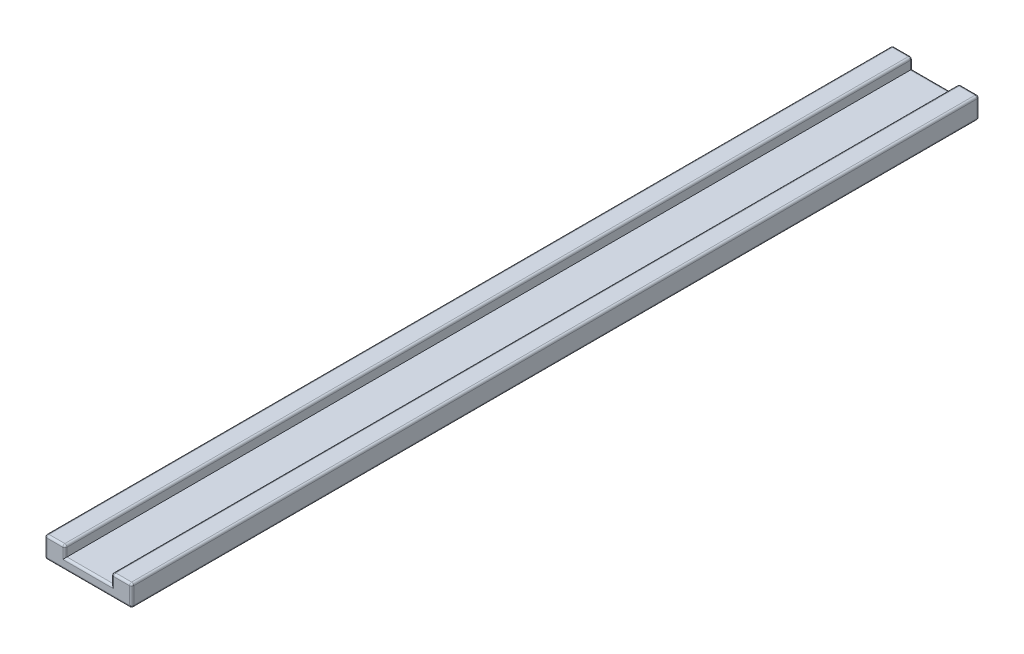
ISO-10303-21;
HEADER;
FILE_DESCRIPTION(('STEP AP214'),'2;1');
FILE_NAME('part.step','',(''),(''),'','','');
FILE_SCHEMA(('AUTOMOTIVE_DESIGN { 1 0 10303 214 1 1 1 1 }'));
ENDSEC;
DATA;
#1=APPLICATION_CONTEXT('core data for automotive mechanical design processes');
#2=APPLICATION_PROTOCOL_DEFINITION('international standard','automotive_design',2000,#1);
#3=PRODUCT_CONTEXT('',#1,'mechanical');
#4=PRODUCT('Part','Part','',(#3));
#5=PRODUCT_RELATED_PRODUCT_CATEGORY('part','',(#4));
#6=PRODUCT_DEFINITION_FORMATION('','',#4);
#7=PRODUCT_DEFINITION_CONTEXT('part definition',#1,'design');
#8=PRODUCT_DEFINITION('design','',#6,#7);
#9=PRODUCT_DEFINITION_SHAPE('','',#8);
#10=(LENGTH_UNIT() NAMED_UNIT(*) SI_UNIT(.MILLI.,.METRE.));
#11=(NAMED_UNIT(*) PLANE_ANGLE_UNIT() SI_UNIT($,.RADIAN.));
#12=(NAMED_UNIT(*) SI_UNIT($,.STERADIAN.) SOLID_ANGLE_UNIT());
#13=UNCERTAINTY_MEASURE_WITH_UNIT(LENGTH_MEASURE(1.E-05),#10,'distance_accuracy_value','');
#14=(GEOMETRIC_REPRESENTATION_CONTEXT(3) GLOBAL_UNCERTAINTY_ASSIGNED_CONTEXT((#13)) GLOBAL_UNIT_ASSIGNED_CONTEXT((#10,
#11,#12)) REPRESENTATION_CONTEXT('',''));
#15=CARTESIAN_POINT('',(0.,0.,0.));
#16=DIRECTION('',(0.,0.,1.));
#17=DIRECTION('',(1.,0.,0.));
#18=AXIS2_PLACEMENT_3D('',#15,#16,#17);
#19=CARTESIAN_POINT('',(11.,5.,400.));
#20=DIRECTION('',(0.,-1.,0.));
#21=DIRECTION('',(0.,0.,-1.));
#22=AXIS2_PLACEMENT_3D('',#19,#20,#21);
#23=PLANE('',#22);
#24=DIRECTION('',(0.,0.,-1.));
#25=VECTOR('',#24,1.);
#26=CARTESIAN_POINT('',(19.5,5.,400.));
#27=LINE('',#26,#25);
#28=CARTESIAN_POINT('',(19.5,5.,399.));
#29=VERTEX_POINT('',#28);
#30=CARTESIAN_POINT('',(19.5,5.,1.));
#31=VERTEX_POINT('',#30);
#32=EDGE_CURVE('E496',#29,#31,#27,.T.);
#33=ORIENTED_EDGE('',*,*,#32,.T.);
#34=DIRECTION('',(-1.,0.,0.));
#35=VECTOR('',#34,1.);
#36=CARTESIAN_POINT('',(11.,5.,1.));
#37=LINE('',#36,#35);
#38=CARTESIAN_POINT('',(12.,5.,1.));
#39=VERTEX_POINT('',#38);
#40=EDGE_CURVE('E294',#31,#39,#37,.T.);
#41=ORIENTED_EDGE('',*,*,#40,.T.);
#42=DIRECTION('',(0.,0.,-1.));
#43=VECTOR('',#42,1.);
#44=CARTESIAN_POINT('',(12.,5.,400.));
#45=LINE('',#44,#43);
#46=CARTESIAN_POINT('',(12.,5.,399.));
#47=VERTEX_POINT('',#46);
#48=EDGE_CURVE('E408',#39,#47,#45,.F.);
#49=ORIENTED_EDGE('',*,*,#48,.T.);
#50=DIRECTION('',(-1.,0.,0.));
#51=VECTOR('',#50,1.);
#52=CARTESIAN_POINT('',(19.5,5.,399.));
#53=LINE('',#52,#51);
#54=EDGE_CURVE('E292',#47,#29,#53,.F.);
#55=ORIENTED_EDGE('',*,*,#54,.T.);
#56=EDGE_LOOP('',(#33,#41,#49,#55));
#57=FACE_BOUND('',#56,.T.);
#58=ADVANCED_FACE('F40',(#57),#23,.F.);
#59=CARTESIAN_POINT('',(11.,0.,400.));
#60=DIRECTION('',(1.,0.,0.));
#61=DIRECTION('',(0.,1.,0.));
#62=AXIS2_PLACEMENT_3D('',#59,#60,#61);
#63=PLANE('',#62);
#64=DIRECTION('',(0.,0.,-1.));
#65=VECTOR('',#64,1.);
#66=CARTESIAN_POINT('',(11.,4.,400.));
#67=LINE('',#66,#65);
#68=CARTESIAN_POINT('',(11.,4.,399.));
#69=VERTEX_POINT('',#68);
#70=CARTESIAN_POINT('',(11.,4.,1.));
#71=VERTEX_POINT('',#70);
#72=EDGE_CURVE('E504',#69,#71,#67,.T.);
#73=ORIENTED_EDGE('',*,*,#72,.T.);
#74=DIRECTION('',(0.,-1.,0.));
#75=VECTOR('',#74,1.);
#76=CARTESIAN_POINT('',(11.,0.,1.));
#77=LINE('',#76,#75);
#78=CARTESIAN_POINT('',(11.,0.,1.));
#79=VERTEX_POINT('',#78);
#80=EDGE_CURVE('E302',#71,#79,#77,.T.);
#81=ORIENTED_EDGE('',*,*,#80,.T.);
#82=DIRECTION('',(0.,0.,-1.));
#83=VECTOR('',#82,1.);
#84=CARTESIAN_POINT('',(11.,0.,400.));
#85=LINE('',#84,#83);
#86=CARTESIAN_POINT('',(11.,0.,399.));
#87=VERTEX_POINT('',#86);
#88=EDGE_CURVE('E212',#87,#79,#85,.T.);
#89=ORIENTED_EDGE('',*,*,#88,.F.);
#90=DIRECTION('',(0.,-1.,0.));
#91=VECTOR('',#90,1.);
#92=CARTESIAN_POINT('',(11.,4.,399.));
#93=LINE('',#92,#91);
#94=EDGE_CURVE('E300',#87,#69,#93,.F.);
#95=ORIENTED_EDGE('',*,*,#94,.T.);
#96=EDGE_LOOP('',(#73,#81,#89,#95));
#97=FACE_BOUND('',#96,.T.);
#98=ADVANCED_FACE('F560',(#97),#63,.F.);
#99=CARTESIAN_POINT('',(-11.,0.,400.));
#100=DIRECTION('',(0.,-1.,0.));
#101=DIRECTION('',(0.,0.,-1.));
#102=AXIS2_PLACEMENT_3D('',#99,#100,#101);
#103=PLANE('',#102);
#104=ORIENTED_EDGE('',*,*,#88,.T.);
#105=DIRECTION('',(-1.,0.,0.));
#106=VECTOR('',#105,1.);
#107=CARTESIAN_POINT('',(-11.,0.,1.));
#108=LINE('',#107,#106);
#109=CARTESIAN_POINT('',(-11.,0.,1.));
#110=VERTEX_POINT('',#109);
#111=EDGE_CURVE('E211',#79,#110,#108,.T.);
#112=ORIENTED_EDGE('',*,*,#111,.T.);
#113=DIRECTION('',(0.,0.,-1.));
#114=VECTOR('',#113,1.);
#115=CARTESIAN_POINT('',(-11.,0.,400.));
#116=LINE('',#115,#114);
#117=CARTESIAN_POINT('',(-11.,0.,399.));
#118=VERTEX_POINT('',#117);
#119=EDGE_CURVE('E193',#118,#110,#116,.T.);
#120=ORIENTED_EDGE('',*,*,#119,.F.);
#121=DIRECTION('',(-1.,0.,0.));
#122=VECTOR('',#121,1.);
#123=CARTESIAN_POINT('',(11.,0.,399.));
#124=LINE('',#123,#122);
#125=EDGE_CURVE('E208',#118,#87,#124,.F.);
#126=ORIENTED_EDGE('',*,*,#125,.T.);
#127=EDGE_LOOP('',(#104,#112,#120,#126));
#128=FACE_BOUND('',#127,.T.);
#129=ADVANCED_FACE('F206',(#128),#103,.F.);
#130=CARTESIAN_POINT('',(-11.,5.,400.));
#131=DIRECTION('',(-1.,0.,0.));
#132=DIRECTION('',(0.,-1.,0.));
#133=AXIS2_PLACEMENT_3D('',#130,#131,#132);
#134=PLANE('',#133);
#135=ORIENTED_EDGE('',*,*,#119,.T.);
#136=DIRECTION('',(0.,1.,0.));
#137=VECTOR('',#136,1.);
#138=CARTESIAN_POINT('',(-11.,5.,1.));
#139=LINE('',#138,#137);
#140=CARTESIAN_POINT('',(-11.,4.,1.));
#141=VERTEX_POINT('',#140);
#142=EDGE_CURVE('E200',#110,#141,#139,.T.);
#143=ORIENTED_EDGE('',*,*,#142,.T.);
#144=DIRECTION('',(0.,0.,-1.));
#145=VECTOR('',#144,1.);
#146=CARTESIAN_POINT('',(-11.,4.,400.));
#147=LINE('',#146,#145);
#148=CARTESIAN_POINT('',(-11.,4.,399.));
#149=VERTEX_POINT('',#148);
#150=EDGE_CURVE('E195',#141,#149,#147,.F.);
#151=ORIENTED_EDGE('',*,*,#150,.T.);
#152=DIRECTION('',(0.,1.,0.));
#153=VECTOR('',#152,1.);
#154=CARTESIAN_POINT('',(-11.,0.,399.));
#155=LINE('',#154,#153);
#156=EDGE_CURVE('E190',#149,#118,#155,.F.);
#157=ORIENTED_EDGE('',*,*,#156,.T.);
#158=EDGE_LOOP('',(#135,#143,#151,#157));
#159=FACE_BOUND('',#158,.T.);
#160=ADVANCED_FACE('F192',(#159),#134,.F.);
#161=CARTESIAN_POINT('',(-20.5,5.,400.));
#162=DIRECTION('',(0.,-1.,0.));
#163=DIRECTION('',(0.,0.,-1.));
#164=AXIS2_PLACEMENT_3D('',#161,#162,#163);
#165=PLANE('',#164);
#166=DIRECTION('',(0.,0.,-1.));
#167=VECTOR('',#166,1.);
#168=CARTESIAN_POINT('',(-12.,5.,400.));
#169=LINE('',#168,#167);
#170=CARTESIAN_POINT('',(-12.,5.,399.));
#171=VERTEX_POINT('',#170);
#172=CARTESIAN_POINT('',(-12.,5.,1.));
#173=VERTEX_POINT('',#172);
#174=EDGE_CURVE('E398',#171,#173,#169,.T.);
#175=ORIENTED_EDGE('',*,*,#174,.T.);
#176=DIRECTION('',(-1.,0.,0.));
#177=VECTOR('',#176,1.);
#178=CARTESIAN_POINT('',(-20.5,5.,1.));
#179=LINE('',#178,#177);
#180=CARTESIAN_POINT('',(-19.5,5.,1.));
#181=VERTEX_POINT('',#180);
#182=EDGE_CURVE('E261',#173,#181,#179,.T.);
#183=ORIENTED_EDGE('',*,*,#182,.T.);
#184=DIRECTION('',(0.,0.,-1.));
#185=VECTOR('',#184,1.);
#186=CARTESIAN_POINT('',(-19.5,5.,400.));
#187=LINE('',#186,#185);
#188=CARTESIAN_POINT('',(-19.5,5.,399.));
#189=VERTEX_POINT('',#188);
#190=EDGE_CURVE('E401',#181,#189,#187,.F.);
#191=ORIENTED_EDGE('',*,*,#190,.T.);
#192=DIRECTION('',(-1.,0.,0.));
#193=VECTOR('',#192,1.);
#194=CARTESIAN_POINT('',(-12.,5.,399.));
#195=LINE('',#194,#193);
#196=EDGE_CURVE('E259',#189,#171,#195,.F.);
#197=ORIENTED_EDGE('',*,*,#196,.T.);
#198=EDGE_LOOP('',(#175,#183,#191,#197));
#199=FACE_BOUND('',#198,.T.);
#200=ADVANCED_FACE('F397',(#199),#165,.F.);
#201=CARTESIAN_POINT('',(-20.5,-5.,400.));
#202=DIRECTION('',(1.,0.,0.));
#203=DIRECTION('',(0.,0.,-1.));
#204=AXIS2_PLACEMENT_3D('',#201,#202,#203);
#205=PLANE('',#204);
#206=DIRECTION('',(0.,0.,-1.));
#207=VECTOR('',#206,1.);
#208=CARTESIAN_POINT('',(-20.5,4.,400.));
#209=LINE('',#208,#207);
#210=CARTESIAN_POINT('',(-20.5,4.,399.));
#211=VERTEX_POINT('',#210);
#212=CARTESIAN_POINT('',(-20.5,4.,1.));
#213=VERTEX_POINT('',#212);
#214=EDGE_CURVE('E235',#211,#213,#209,.T.);
#215=ORIENTED_EDGE('',*,*,#214,.T.);
#216=DIRECTION('',(0.,-1.,0.));
#217=VECTOR('',#216,1.);
#218=CARTESIAN_POINT('',(-20.5,-5.,1.));
#219=LINE('',#218,#217);
#220=CARTESIAN_POINT('',(-20.5,-4.,1.));
#221=VERTEX_POINT('',#220);
#222=EDGE_CURVE('E269',#213,#221,#219,.T.);
#223=ORIENTED_EDGE('',*,*,#222,.T.);
#224=DIRECTION('',(0.,0.,-1.));
#225=VECTOR('',#224,1.);
#226=CARTESIAN_POINT('',(-20.5,-4.,400.));
#227=LINE('',#226,#225);
#228=CARTESIAN_POINT('',(-20.5,-4.,399.));
#229=VERTEX_POINT('',#228);
#230=EDGE_CURVE('E230',#221,#229,#227,.F.);
#231=ORIENTED_EDGE('',*,*,#230,.T.);
#232=DIRECTION('',(0.,-1.,0.));
#233=VECTOR('',#232,1.);
#234=CARTESIAN_POINT('',(-20.5,4.,399.));
#235=LINE('',#234,#233);
#236=EDGE_CURVE('E267',#229,#211,#235,.F.);
#237=ORIENTED_EDGE('',*,*,#236,.T.);
#238=EDGE_LOOP('',(#215,#223,#231,#237));
#239=FACE_BOUND('',#238,.T.);
#240=ADVANCED_FACE('F426',(#239),#205,.F.);
#241=CARTESIAN_POINT('',(-20.5,-5.,400.));
#242=DIRECTION('',(0.,1.,0.));
#243=DIRECTION('',(0.,0.,1.));
#244=AXIS2_PLACEMENT_3D('',#241,#242,#243);
#245=PLANE('',#244);
#246=DIRECTION('',(0.,0.,-1.));
#247=VECTOR('',#246,1.);
#248=CARTESIAN_POINT('',(-19.5,-5.,400.));
#249=LINE('',#248,#247);
#250=CARTESIAN_POINT('',(-19.5,-5.,399.));
#251=VERTEX_POINT('',#250);
#252=CARTESIAN_POINT('',(-19.5,-5.,1.));
#253=VERTEX_POINT('',#252);
#254=EDGE_CURVE('E417',#251,#253,#249,.T.);
#255=ORIENTED_EDGE('',*,*,#254,.T.);
#256=DIRECTION('',(1.,0.,0.));
#257=VECTOR('',#256,1.);
#258=CARTESIAN_POINT('',(-20.5,-5.,1.));
#259=LINE('',#258,#257);
#260=CARTESIAN_POINT('',(19.5,-5.,1.));
#261=VERTEX_POINT('',#260);
#262=EDGE_CURVE('E277',#253,#261,#259,.T.);
#263=ORIENTED_EDGE('',*,*,#262,.T.);
#264=DIRECTION('',(0.,0.,-1.));
#265=VECTOR('',#264,1.);
#266=CARTESIAN_POINT('',(19.5,-5.,400.));
#267=LINE('',#266,#265);
#268=CARTESIAN_POINT('',(19.5,-5.,399.));
#269=VERTEX_POINT('',#268);
#270=EDGE_CURVE('E420',#261,#269,#267,.F.);
#271=ORIENTED_EDGE('',*,*,#270,.T.);
#272=DIRECTION('',(1.,0.,0.));
#273=VECTOR('',#272,1.);
#274=CARTESIAN_POINT('',(-19.5,-5.,399.));
#275=LINE('',#274,#273);
#276=EDGE_CURVE('E275',#269,#251,#275,.F.);
#277=ORIENTED_EDGE('',*,*,#276,.T.);
#278=EDGE_LOOP('',(#255,#263,#271,#277));
#279=FACE_BOUND('',#278,.T.);
#280=ADVANCED_FACE('F463',(#279),#245,.F.);
#281=CARTESIAN_POINT('',(20.5,-5.,400.));
#282=DIRECTION('',(-1.,0.,0.));
#283=DIRECTION('',(0.,0.,1.));
#284=AXIS2_PLACEMENT_3D('',#281,#282,#283);
#285=PLANE('',#284);
#286=DIRECTION('',(0.,0.,-1.));
#287=VECTOR('',#286,1.);
#288=CARTESIAN_POINT('',(20.5,-4.,400.));
#289=LINE('',#288,#287);
#290=CARTESIAN_POINT('',(20.5,-4.,399.));
#291=VERTEX_POINT('',#290);
#292=CARTESIAN_POINT('',(20.5,-4.,1.));
#293=VERTEX_POINT('',#292);
#294=EDGE_CURVE('E414',#291,#293,#289,.T.);
#295=ORIENTED_EDGE('',*,*,#294,.T.);
#296=DIRECTION('',(0.,1.,0.));
#297=VECTOR('',#296,1.);
#298=CARTESIAN_POINT('',(20.5,-5.,1.));
#299=LINE('',#298,#297);
#300=CARTESIAN_POINT('',(20.5,4.,1.));
#301=VERTEX_POINT('',#300);
#302=EDGE_CURVE('E285',#293,#301,#299,.T.);
#303=ORIENTED_EDGE('',*,*,#302,.T.);
#304=DIRECTION('',(0.,0.,-1.));
#305=VECTOR('',#304,1.);
#306=CARTESIAN_POINT('',(20.5,4.,400.));
#307=LINE('',#306,#305);
#308=CARTESIAN_POINT('',(20.5,4.,399.));
#309=VERTEX_POINT('',#308);
#310=EDGE_CURVE('E406',#301,#309,#307,.F.);
#311=ORIENTED_EDGE('',*,*,#310,.T.);
#312=DIRECTION('',(0.,1.,0.));
#313=VECTOR('',#312,1.);
#314=CARTESIAN_POINT('',(20.5,-4.,399.));
#315=LINE('',#314,#313);
#316=EDGE_CURVE('E283',#309,#291,#315,.F.);
#317=ORIENTED_EDGE('',*,*,#316,.T.);
#318=EDGE_LOOP('',(#295,#303,#311,#317));
#319=FACE_BOUND('',#318,.T.);
#320=ADVANCED_FACE('F510',(#319),#285,.F.);
#321=CARTESIAN_POINT('',(0.,0.,400.));
#322=DIRECTION('',(0.,0.,1.));
#323=DIRECTION('',(1.,0.,0.));
#324=AXIS2_PLACEMENT_3D('',#321,#322,#323);
#325=PLANE('',#324);
#326=DIRECTION('',(1.,0.,0.));
#327=VECTOR('',#326,1.);
#328=CARTESIAN_POINT('',(19.5,-4.,400.));
#329=LINE('',#328,#327);
#330=CARTESIAN_POINT('',(-19.5,-4.,400.));
#331=VERTEX_POINT('',#330);
#332=CARTESIAN_POINT('',(19.5,-4.,400.));
#333=VERTEX_POINT('',#332);
#334=EDGE_CURVE('E49',#331,#333,#329,.T.);
#335=ORIENTED_EDGE('',*,*,#334,.T.);
#336=DIRECTION('',(0.,1.,0.));
#337=VECTOR('',#336,1.);
#338=CARTESIAN_POINT('',(19.5,4.,400.));
#339=LINE('',#338,#337);
#340=CARTESIAN_POINT('',(19.5,4.,400.));
#341=VERTEX_POINT('',#340);
#342=EDGE_CURVE('E11',#333,#341,#339,.T.);
#343=ORIENTED_EDGE('',*,*,#342,.T.);
#344=DIRECTION('',(-1.,0.,0.));
#345=VECTOR('',#344,1.);
#346=CARTESIAN_POINT('',(12.,4.,400.));
#347=LINE('',#346,#345);
#348=CARTESIAN_POINT('',(12.,4.,400.));
#349=VERTEX_POINT('',#348);
#350=EDGE_CURVE('E304',#341,#349,#347,.T.);
#351=ORIENTED_EDGE('',*,*,#350,.T.);
#352=DIRECTION('',(0.,-1.,0.));
#353=VECTOR('',#352,1.);
#354=CARTESIAN_POINT('',(12.,0.,400.));
#355=LINE('',#354,#353);
#356=CARTESIAN_POINT('',(12.,-1.,400.));
#357=VERTEX_POINT('',#356);
#358=EDGE_CURVE('E306',#349,#357,#355,.T.);
#359=ORIENTED_EDGE('',*,*,#358,.T.);
#360=DIRECTION('',(-1.,0.,0.));
#361=VECTOR('',#360,1.);
#362=CARTESIAN_POINT('',(-11.,-1.,400.));
#363=LINE('',#362,#361);
#364=CARTESIAN_POINT('',(-12.,-1.,400.));
#365=VERTEX_POINT('',#364);
#366=EDGE_CURVE('E308',#357,#365,#363,.T.);
#367=ORIENTED_EDGE('',*,*,#366,.T.);
#368=DIRECTION('',(0.,1.,0.));
#369=VECTOR('',#368,1.);
#370=CARTESIAN_POINT('',(-12.,4.,400.));
#371=LINE('',#370,#369);
#372=CARTESIAN_POINT('',(-12.,4.,400.));
#373=VERTEX_POINT('',#372);
#374=EDGE_CURVE('E219',#365,#373,#371,.T.);
#375=ORIENTED_EDGE('',*,*,#374,.T.);
#376=DIRECTION('',(-1.,0.,0.));
#377=VECTOR('',#376,1.);
#378=CARTESIAN_POINT('',(-19.5,4.,400.));
#379=LINE('',#378,#377);
#380=CARTESIAN_POINT('',(-19.5,4.,400.));
#381=VERTEX_POINT('',#380);
#382=EDGE_CURVE('E311',#373,#381,#379,.T.);
#383=ORIENTED_EDGE('',*,*,#382,.T.);
#384=DIRECTION('',(0.,-1.,0.));
#385=VECTOR('',#384,1.);
#386=CARTESIAN_POINT('',(-19.5,-4.,400.));
#387=LINE('',#386,#385);
#388=EDGE_CURVE('E60',#381,#331,#387,.T.);
#389=ORIENTED_EDGE('',*,*,#388,.T.);
#390=EDGE_LOOP('',(#335,#343,#351,#359,#367,#375,#383,#389));
#391=FACE_BOUND('',#390,.T.);
#392=ADVANCED_FACE('F479',(#391),#325,.T.);
#393=CARTESIAN_POINT('',(0.,0.,0.));
#394=DIRECTION('',(0.,0.,1.));
#395=DIRECTION('',(1.,0.,0.));
#396=AXIS2_PLACEMENT_3D('',#393,#394,#395);
#397=PLANE('',#396);
#398=DIRECTION('',(0.,1.,0.));
#399=VECTOR('',#398,1.);
#400=CARTESIAN_POINT('',(-12.,0.,0.));
#401=LINE('',#400,#399);
#402=CARTESIAN_POINT('',(-12.,4.,0.));
#403=VERTEX_POINT('',#402);
#404=CARTESIAN_POINT('',(-12.,-1.,0.));
#405=VERTEX_POINT('',#404);
#406=EDGE_CURVE('E250',#403,#405,#401,.F.);
#407=ORIENTED_EDGE('',*,*,#406,.T.);
#408=DIRECTION('',(-1.,0.,0.));
#409=VECTOR('',#408,1.);
#410=CARTESIAN_POINT('',(0.,-1.,0.));
#411=LINE('',#410,#409);
#412=CARTESIAN_POINT('',(12.,-1.,0.));
#413=VERTEX_POINT('',#412);
#414=EDGE_CURVE('E201',#405,#413,#411,.F.);
#415=ORIENTED_EDGE('',*,*,#414,.T.);
#416=DIRECTION('',(0.,-1.,0.));
#417=VECTOR('',#416,1.);
#418=CARTESIAN_POINT('',(12.,0.,0.));
#419=LINE('',#418,#417);
#420=CARTESIAN_POINT('',(12.,4.,0.));
#421=VERTEX_POINT('',#420);
#422=EDGE_CURVE('E232',#413,#421,#419,.F.);
#423=ORIENTED_EDGE('',*,*,#422,.T.);
#424=DIRECTION('',(-1.,0.,0.));
#425=VECTOR('',#424,1.);
#426=CARTESIAN_POINT('',(0.,4.,0.));
#427=LINE('',#426,#425);
#428=CARTESIAN_POINT('',(19.5,4.,0.));
#429=VERTEX_POINT('',#428);
#430=EDGE_CURVE('E240',#421,#429,#427,.F.);
#431=ORIENTED_EDGE('',*,*,#430,.T.);
#432=DIRECTION('',(0.,1.,0.));
#433=VECTOR('',#432,1.);
#434=CARTESIAN_POINT('',(19.5,0.,0.));
#435=LINE('',#434,#433);
#436=CARTESIAN_POINT('',(19.5,-4.,0.));
#437=VERTEX_POINT('',#436);
#438=EDGE_CURVE('E242',#429,#437,#435,.F.);
#439=ORIENTED_EDGE('',*,*,#438,.T.);
#440=DIRECTION('',(1.,0.,0.));
#441=VECTOR('',#440,1.);
#442=CARTESIAN_POINT('',(0.,-4.,0.));
#443=LINE('',#442,#441);
#444=CARTESIAN_POINT('',(-19.5,-4.,0.));
#445=VERTEX_POINT('',#444);
#446=EDGE_CURVE('E244',#437,#445,#443,.F.);
#447=ORIENTED_EDGE('',*,*,#446,.T.);
#448=DIRECTION('',(0.,-1.,0.));
#449=VECTOR('',#448,1.);
#450=CARTESIAN_POINT('',(-19.5,0.,0.));
#451=LINE('',#450,#449);
#452=CARTESIAN_POINT('',(-19.5,4.,0.));
#453=VERTEX_POINT('',#452);
#454=EDGE_CURVE('E246',#445,#453,#451,.F.);
#455=ORIENTED_EDGE('',*,*,#454,.T.);
#456=DIRECTION('',(-1.,0.,0.));
#457=VECTOR('',#456,1.);
#458=CARTESIAN_POINT('',(0.,4.,0.));
#459=LINE('',#458,#457);
#460=EDGE_CURVE('E248',#453,#403,#459,.F.);
#461=ORIENTED_EDGE('',*,*,#460,.T.);
#462=EDGE_LOOP('',(#407,#415,#423,#431,#439,#447,#455,#461));
#463=FACE_BOUND('',#462,.T.);
#464=ADVANCED_FACE('F445',(#463),#397,.F.);
#465=CARTESIAN_POINT('',(12.,4.,400.));
#466=DIRECTION('',(0.,0.,-1.));
#467=DIRECTION('',(-1.,0.,0.));
#468=AXIS2_PLACEMENT_3D('',#465,#466,#467);
#469=CYLINDRICAL_SURFACE('',#468,1.);
#470=ORIENTED_EDGE('',*,*,#48,.F.);
#471=CARTESIAN_POINT('',(12.,4.,1.));
#472=DIRECTION('',(0.,0.,-1.));
#473=DIRECTION('',(-1.,0.,0.));
#474=AXIS2_PLACEMENT_3D('',#471,#472,#473);
#475=CIRCLE('',#474,1.);
#476=EDGE_CURVE('E298',#39,#71,#475,.F.);
#477=ORIENTED_EDGE('',*,*,#476,.T.);
#478=ORIENTED_EDGE('',*,*,#72,.F.);
#479=CARTESIAN_POINT('',(12.,4.,399.));
#480=DIRECTION('',(0.,0.,-1.));
#481=DIRECTION('',(-1.,0.,0.));
#482=AXIS2_PLACEMENT_3D('',#479,#480,#481);
#483=CIRCLE('',#482,1.);
#484=EDGE_CURVE('E296',#69,#47,#483,.T.);
#485=ORIENTED_EDGE('',*,*,#484,.T.);
#486=EDGE_LOOP('',(#470,#477,#478,#485));
#487=FACE_BOUND('',#486,.T.);
#488=ADVANCED_FACE('F530',(#487),#469,.T.);
#489=CARTESIAN_POINT('',(-12.,4.,400.));
#490=DIRECTION('',(0.,0.,-1.));
#491=DIRECTION('',(-1.,0.,0.));
#492=AXIS2_PLACEMENT_3D('',#489,#490,#491);
#493=CYLINDRICAL_SURFACE('',#492,1.);
#494=ORIENTED_EDGE('',*,*,#150,.F.);
#495=CARTESIAN_POINT('',(-12.,4.,1.));
#496=DIRECTION('',(0.,0.,-1.));
#497=DIRECTION('',(-1.,0.,0.));
#498=AXIS2_PLACEMENT_3D('',#495,#496,#497);
#499=CIRCLE('',#498,1.);
#500=EDGE_CURVE('E257',#141,#173,#499,.F.);
#501=ORIENTED_EDGE('',*,*,#500,.T.);
#502=ORIENTED_EDGE('',*,*,#174,.F.);
#503=CARTESIAN_POINT('',(-12.,4.,399.));
#504=DIRECTION('',(0.,0.,-1.));
#505=DIRECTION('',(-1.,0.,0.));
#506=AXIS2_PLACEMENT_3D('',#503,#504,#505);
#507=CIRCLE('',#506,1.);
#508=EDGE_CURVE('E255',#171,#149,#507,.T.);
#509=ORIENTED_EDGE('',*,*,#508,.T.);
#510=EDGE_LOOP('',(#494,#501,#502,#509));
#511=FACE_BOUND('',#510,.T.);
#512=ADVANCED_FACE('F403',(#511),#493,.T.);
#513=CARTESIAN_POINT('',(19.5,-4.,400.));
#514=DIRECTION('',(0.,0.,-1.));
#515=DIRECTION('',(-1.,0.,0.));
#516=AXIS2_PLACEMENT_3D('',#513,#514,#515);
#517=CYLINDRICAL_SURFACE('',#516,1.);
#518=ORIENTED_EDGE('',*,*,#270,.F.);
#519=CARTESIAN_POINT('',(19.5,-4.,1.));
#520=DIRECTION('',(0.,0.,-1.));
#521=DIRECTION('',(-1.,0.,0.));
#522=AXIS2_PLACEMENT_3D('',#519,#520,#521);
#523=CIRCLE('',#522,1.);
#524=EDGE_CURVE('E281',#261,#293,#523,.F.);
#525=ORIENTED_EDGE('',*,*,#524,.T.);
#526=ORIENTED_EDGE('',*,*,#294,.F.);
#527=CARTESIAN_POINT('',(19.5,-4.,399.));
#528=DIRECTION('',(0.,0.,-1.));
#529=DIRECTION('',(-1.,0.,0.));
#530=AXIS2_PLACEMENT_3D('',#527,#528,#529);
#531=CIRCLE('',#530,1.);
#532=EDGE_CURVE('E279',#291,#269,#531,.T.);
#533=ORIENTED_EDGE('',*,*,#532,.T.);
#534=EDGE_LOOP('',(#518,#525,#526,#533));
#535=FACE_BOUND('',#534,.T.);
#536=ADVANCED_FACE('F513',(#535),#517,.T.);
#537=CARTESIAN_POINT('',(-19.5,-4.,400.));
#538=DIRECTION('',(0.,0.,-1.));
#539=DIRECTION('',(-1.,0.,0.));
#540=AXIS2_PLACEMENT_3D('',#537,#538,#539);
#541=CYLINDRICAL_SURFACE('',#540,1.);
#542=ORIENTED_EDGE('',*,*,#230,.F.);
#543=CARTESIAN_POINT('',(-19.5,-4.,1.));
#544=DIRECTION('',(0.,0.,-1.));
#545=DIRECTION('',(-1.,0.,0.));
#546=AXIS2_PLACEMENT_3D('',#543,#544,#545);
#547=CIRCLE('',#546,1.);
#548=EDGE_CURVE('E273',#221,#253,#547,.F.);
#549=ORIENTED_EDGE('',*,*,#548,.T.);
#550=ORIENTED_EDGE('',*,*,#254,.F.);
#551=CARTESIAN_POINT('',(-19.5,-4.,399.));
#552=DIRECTION('',(0.,0.,-1.));
#553=DIRECTION('',(-1.,0.,0.));
#554=AXIS2_PLACEMENT_3D('',#551,#552,#553);
#555=CIRCLE('',#554,1.);
#556=EDGE_CURVE('E271',#251,#229,#555,.T.);
#557=ORIENTED_EDGE('',*,*,#556,.T.);
#558=EDGE_LOOP('',(#542,#549,#550,#557));
#559=FACE_BOUND('',#558,.T.);
#560=ADVANCED_FACE('F460',(#559),#541,.T.);
#561=CARTESIAN_POINT('',(-19.5,4.,400.));
#562=DIRECTION('',(0.,0.,-1.));
#563=DIRECTION('',(-1.,0.,0.));
#564=AXIS2_PLACEMENT_3D('',#561,#562,#563);
#565=CYLINDRICAL_SURFACE('',#564,1.);
#566=ORIENTED_EDGE('',*,*,#190,.F.);
#567=CARTESIAN_POINT('',(-19.5,4.,1.));
#568=DIRECTION('',(0.,0.,-1.));
#569=DIRECTION('',(-1.,0.,0.));
#570=AXIS2_PLACEMENT_3D('',#567,#568,#569);
#571=CIRCLE('',#570,1.);
#572=EDGE_CURVE('E265',#181,#213,#571,.F.);
#573=ORIENTED_EDGE('',*,*,#572,.T.);
#574=ORIENTED_EDGE('',*,*,#214,.F.);
#575=CARTESIAN_POINT('',(-19.5,4.,399.));
#576=DIRECTION('',(0.,0.,-1.));
#577=DIRECTION('',(-1.,0.,0.));
#578=AXIS2_PLACEMENT_3D('',#575,#576,#577);
#579=CIRCLE('',#578,1.);
#580=EDGE_CURVE('E263',#211,#189,#579,.T.);
#581=ORIENTED_EDGE('',*,*,#580,.T.);
#582=EDGE_LOOP('',(#566,#573,#574,#581));
#583=FACE_BOUND('',#582,.T.);
#584=ADVANCED_FACE('F576',(#583),#565,.T.);
#585=CARTESIAN_POINT('',(19.5,4.,400.));
#586=DIRECTION('',(0.,0.,-1.));
#587=DIRECTION('',(-1.,0.,0.));
#588=AXIS2_PLACEMENT_3D('',#585,#586,#587);
#589=CYLINDRICAL_SURFACE('',#588,1.);
#590=ORIENTED_EDGE('',*,*,#310,.F.);
#591=CARTESIAN_POINT('',(19.5,4.,1.));
#592=DIRECTION('',(0.,0.,-1.));
#593=DIRECTION('',(-1.,0.,0.));
#594=AXIS2_PLACEMENT_3D('',#591,#592,#593);
#595=CIRCLE('',#594,1.);
#596=EDGE_CURVE('E290',#301,#31,#595,.F.);
#597=ORIENTED_EDGE('',*,*,#596,.T.);
#598=ORIENTED_EDGE('',*,*,#32,.F.);
#599=CARTESIAN_POINT('',(19.5,4.,399.));
#600=DIRECTION('',(0.,0.,-1.));
#601=DIRECTION('',(-1.,0.,0.));
#602=AXIS2_PLACEMENT_3D('',#599,#600,#601);
#603=CIRCLE('',#602,1.);
#604=EDGE_CURVE('E287',#29,#309,#603,.T.);
#605=ORIENTED_EDGE('',*,*,#604,.T.);
#606=EDGE_LOOP('',(#590,#597,#598,#605));
#607=FACE_BOUND('',#606,.T.);
#608=ADVANCED_FACE('F502',(#607),#589,.T.);
#609=CARTESIAN_POINT('',(-20.5,-4.,1.));
#610=DIRECTION('',(1.,0.,0.));
#611=DIRECTION('',(0.,0.,-1.));
#612=AXIS2_PLACEMENT_3D('',#609,#610,#611);
#613=CYLINDRICAL_SURFACE('',#612,1.);
#614=CARTESIAN_POINT('',(19.5,-4.,1.));
#615=DIRECTION('',(1.,0.,0.));
#616=DIRECTION('',(0.,0.,-1.));
#617=AXIS2_PLACEMENT_3D('',#614,#615,#616);
#618=CIRCLE('',#617,1.);
#619=EDGE_CURVE('E213',#261,#437,#618,.T.);
#620=ORIENTED_EDGE('',*,*,#619,.F.);
#621=ORIENTED_EDGE('',*,*,#262,.F.);
#622=CARTESIAN_POINT('',(-19.5,-4.,1.));
#623=DIRECTION('',(-1.,0.,0.));
#624=DIRECTION('',(0.,0.,1.));
#625=AXIS2_PLACEMENT_3D('',#622,#623,#624);
#626=CIRCLE('',#625,1.);
#627=EDGE_CURVE('E349',#445,#253,#626,.T.);
#628=ORIENTED_EDGE('',*,*,#627,.F.);
#629=ORIENTED_EDGE('',*,*,#446,.F.);
#630=EDGE_LOOP('',(#620,#621,#628,#629));
#631=FACE_BOUND('',#630,.T.);
#632=ADVANCED_FACE('F454',(#631),#613,.T.);
#633=CARTESIAN_POINT('',(19.5,-4.,1.));
#634=DIRECTION('',(0.,0.,1.));
#635=DIRECTION('',(1.,0.,0.));
#636=AXIS2_PLACEMENT_3D('',#633,#634,#635);
#637=SPHERICAL_SURFACE('',#636,1.);
#638=ORIENTED_EDGE('',*,*,#524,.F.);
#639=ORIENTED_EDGE('',*,*,#619,.T.);
#640=CARTESIAN_POINT('',(19.5,-4.,1.));
#641=DIRECTION('',(0.,1.,0.));
#642=DIRECTION('',(0.,0.,1.));
#643=AXIS2_PLACEMENT_3D('',#640,#641,#642);
#644=CIRCLE('',#643,1.);
#645=EDGE_CURVE('E346',#293,#437,#644,.T.);
#646=ORIENTED_EDGE('',*,*,#645,.F.);
#647=EDGE_LOOP('',(#638,#639,#646));
#648=FACE_BOUND('',#647,.T.);
#649=ADVANCED_FACE('F516',(#648),#637,.T.);
#650=CARTESIAN_POINT('',(-19.5,-4.,1.));
#651=DIRECTION('',(0.,0.,1.));
#652=DIRECTION('',(1.,0.,0.));
#653=AXIS2_PLACEMENT_3D('',#650,#651,#652);
#654=SPHERICAL_SURFACE('',#653,1.);
#655=ORIENTED_EDGE('',*,*,#627,.T.);
#656=ORIENTED_EDGE('',*,*,#548,.F.);
#657=CARTESIAN_POINT('',(-19.5,-4.,1.));
#658=DIRECTION('',(0.,1.,0.));
#659=DIRECTION('',(0.,0.,1.));
#660=AXIS2_PLACEMENT_3D('',#657,#658,#659);
#661=CIRCLE('',#660,1.);
#662=EDGE_CURVE('E343',#445,#221,#661,.T.);
#663=ORIENTED_EDGE('',*,*,#662,.F.);
#664=EDGE_LOOP('',(#655,#656,#663));
#665=FACE_BOUND('',#664,.T.);
#666=ADVANCED_FACE('F457',(#665),#654,.T.);
#667=CARTESIAN_POINT('',(19.5,-5.,1.));
#668=DIRECTION('',(0.,1.,0.));
#669=DIRECTION('',(0.,0.,1.));
#670=AXIS2_PLACEMENT_3D('',#667,#668,#669);
#671=CYLINDRICAL_SURFACE('',#670,1.);
#672=ORIENTED_EDGE('',*,*,#645,.T.);
#673=ORIENTED_EDGE('',*,*,#438,.F.);
#674=CARTESIAN_POINT('',(19.5,4.,1.));
#675=DIRECTION('',(0.,1.,0.));
#676=DIRECTION('',(0.,0.,1.));
#677=AXIS2_PLACEMENT_3D('',#674,#675,#676);
#678=CIRCLE('',#677,1.);
#679=EDGE_CURVE('E340',#301,#429,#678,.T.);
#680=ORIENTED_EDGE('',*,*,#679,.F.);
#681=ORIENTED_EDGE('',*,*,#302,.F.);
#682=EDGE_LOOP('',(#672,#673,#680,#681));
#683=FACE_BOUND('',#682,.T.);
#684=ADVANCED_FACE('F520',(#683),#671,.T.);
#685=CARTESIAN_POINT('',(-19.5,-5.,1.));
#686=DIRECTION('',(0.,-1.,0.));
#687=DIRECTION('',(0.,0.,-1.));
#688=AXIS2_PLACEMENT_3D('',#685,#686,#687);
#689=CYLINDRICAL_SURFACE('',#688,1.);
#690=ORIENTED_EDGE('',*,*,#662,.T.);
#691=ORIENTED_EDGE('',*,*,#222,.F.);
#692=CARTESIAN_POINT('',(-19.5,4.,1.));
#693=DIRECTION('',(0.,1.,0.));
#694=DIRECTION('',(0.,0.,1.));
#695=AXIS2_PLACEMENT_3D('',#692,#693,#694);
#696=CIRCLE('',#695,1.);
#697=EDGE_CURVE('E337',#453,#213,#696,.T.);
#698=ORIENTED_EDGE('',*,*,#697,.F.);
#699=ORIENTED_EDGE('',*,*,#454,.F.);
#700=EDGE_LOOP('',(#690,#691,#698,#699));
#701=FACE_BOUND('',#700,.T.);
#702=ADVANCED_FACE('F432',(#701),#689,.T.);
#703=CARTESIAN_POINT('',(19.5,4.,1.));
#704=DIRECTION('',(0.,0.,1.));
#705=DIRECTION('',(1.,0.,0.));
#706=AXIS2_PLACEMENT_3D('',#703,#704,#705);
#707=SPHERICAL_SURFACE('',#706,1.);
#708=ORIENTED_EDGE('',*,*,#596,.F.);
#709=ORIENTED_EDGE('',*,*,#679,.T.);
#710=CARTESIAN_POINT('',(19.5,4.,1.));
#711=DIRECTION('',(-1.,0.,0.));
#712=DIRECTION('',(0.,0.,1.));
#713=AXIS2_PLACEMENT_3D('',#710,#711,#712);
#714=CIRCLE('',#713,1.);
#715=EDGE_CURVE('E334',#31,#429,#714,.T.);
#716=ORIENTED_EDGE('',*,*,#715,.F.);
#717=EDGE_LOOP('',(#708,#709,#716));
#718=FACE_BOUND('',#717,.T.);
#719=ADVANCED_FACE('F522',(#718),#707,.T.);
#720=CARTESIAN_POINT('',(-19.5,4.,1.));
#721=DIRECTION('',(0.,0.,1.));
#722=DIRECTION('',(1.,0.,0.));
#723=AXIS2_PLACEMENT_3D('',#720,#721,#722);
#724=SPHERICAL_SURFACE('',#723,1.);
#725=ORIENTED_EDGE('',*,*,#697,.T.);
#726=ORIENTED_EDGE('',*,*,#572,.F.);
#727=CARTESIAN_POINT('',(-19.5,4.,1.));
#728=DIRECTION('',(1.,0.,0.));
#729=DIRECTION('',(0.,0.,-1.));
#730=AXIS2_PLACEMENT_3D('',#727,#728,#729);
#731=CIRCLE('',#730,1.);
#732=EDGE_CURVE('E331',#453,#181,#731,.T.);
#733=ORIENTED_EDGE('',*,*,#732,.F.);
#734=EDGE_LOOP('',(#725,#726,#733));
#735=FACE_BOUND('',#734,.T.);
#736=ADVANCED_FACE('F438',(#735),#724,.T.);
#737=CARTESIAN_POINT('',(11.,4.,1.));
#738=DIRECTION('',(-1.,0.,0.));
#739=DIRECTION('',(0.,0.,1.));
#740=AXIS2_PLACEMENT_3D('',#737,#738,#739);
#741=CYLINDRICAL_SURFACE('',#740,1.);
#742=ORIENTED_EDGE('',*,*,#715,.T.);
#743=ORIENTED_EDGE('',*,*,#430,.F.);
#744=CARTESIAN_POINT('',(12.,4.,1.));
#745=DIRECTION('',(-1.,0.,0.));
#746=DIRECTION('',(0.,0.,1.));
#747=AXIS2_PLACEMENT_3D('',#744,#745,#746);
#748=CIRCLE('',#747,1.);
#749=EDGE_CURVE('E328',#39,#421,#748,.T.);
#750=ORIENTED_EDGE('',*,*,#749,.F.);
#751=ORIENTED_EDGE('',*,*,#40,.F.);
#752=EDGE_LOOP('',(#742,#743,#750,#751));
#753=FACE_BOUND('',#752,.T.);
#754=ADVANCED_FACE('F527',(#753),#741,.T.);
#755=CARTESIAN_POINT('',(-20.5,4.,1.));
#756=DIRECTION('',(-1.,0.,0.));
#757=DIRECTION('',(0.,0.,1.));
#758=AXIS2_PLACEMENT_3D('',#755,#756,#757);
#759=CYLINDRICAL_SURFACE('',#758,1.);
#760=ORIENTED_EDGE('',*,*,#732,.T.);
#761=ORIENTED_EDGE('',*,*,#182,.F.);
#762=CARTESIAN_POINT('',(-12.,4.,1.));
#763=DIRECTION('',(1.,0.,0.));
#764=DIRECTION('',(0.,0.,-1.));
#765=AXIS2_PLACEMENT_3D('',#762,#763,#764);
#766=CIRCLE('',#765,1.);
#767=EDGE_CURVE('E325',#403,#173,#766,.T.);
#768=ORIENTED_EDGE('',*,*,#767,.F.);
#769=ORIENTED_EDGE('',*,*,#460,.F.);
#770=EDGE_LOOP('',(#760,#761,#768,#769));
#771=FACE_BOUND('',#770,.T.);
#772=ADVANCED_FACE('F442',(#771),#759,.T.);
#773=CARTESIAN_POINT('',(12.,4.,1.));
#774=DIRECTION('',(0.,0.,1.));
#775=DIRECTION('',(1.,0.,0.));
#776=AXIS2_PLACEMENT_3D('',#773,#774,#775);
#777=SPHERICAL_SURFACE('',#776,1.);
#778=ORIENTED_EDGE('',*,*,#476,.F.);
#779=ORIENTED_EDGE('',*,*,#749,.T.);
#780=CARTESIAN_POINT('',(12.,4.,1.));
#781=DIRECTION('',(0.,-1.,0.));
#782=DIRECTION('',(1.,0.,0.));
#783=AXIS2_PLACEMENT_3D('',#780,#781,#782);
#784=CIRCLE('',#783,1.);
#785=EDGE_CURVE('E322',#71,#421,#784,.T.);
#786=ORIENTED_EDGE('',*,*,#785,.F.);
#787=EDGE_LOOP('',(#778,#779,#786));
#788=FACE_BOUND('',#787,.T.);
#789=ADVANCED_FACE('F550',(#788),#777,.T.);
#790=CARTESIAN_POINT('',(-12.,4.,1.));
#791=DIRECTION('',(0.,0.,1.));
#792=DIRECTION('',(1.,0.,0.));
#793=AXIS2_PLACEMENT_3D('',#790,#791,#792);
#794=SPHERICAL_SURFACE('',#793,1.);
#795=ORIENTED_EDGE('',*,*,#767,.T.);
#796=ORIENTED_EDGE('',*,*,#500,.F.);
#797=CARTESIAN_POINT('',(-12.,4.,1.));
#798=DIRECTION('',(0.,-1.,0.));
#799=DIRECTION('',(1.,0.,0.));
#800=AXIS2_PLACEMENT_3D('',#797,#798,#799);
#801=CIRCLE('',#800,1.);
#802=EDGE_CURVE('E319',#403,#141,#801,.T.);
#803=ORIENTED_EDGE('',*,*,#802,.F.);
#804=EDGE_LOOP('',(#795,#796,#803));
#805=FACE_BOUND('',#804,.T.);
#806=ADVANCED_FACE('F548',(#805),#794,.T.);
#807=CARTESIAN_POINT('',(12.,0.,1.));
#808=DIRECTION('',(0.,-1.,0.));
#809=DIRECTION('',(1.,0.,0.));
#810=AXIS2_PLACEMENT_3D('',#807,#808,#809);
#811=CYLINDRICAL_SURFACE('',#810,1.);
#812=ORIENTED_EDGE('',*,*,#785,.T.);
#813=ORIENTED_EDGE('',*,*,#422,.F.);
#814=CARTESIAN_POINT('',(12.,-1.,1.));
#815=DIRECTION('',(-0.707106781186547,-0.707106781186548,0.));
#816=DIRECTION('',(-0.707106781186548,0.707106781186547,0.));
#817=AXIS2_PLACEMENT_3D('',#814,#815,#816);
#818=ELLIPSE('',#817,1.4142135623731,1.);
#819=EDGE_CURVE('E317',#79,#413,#818,.T.);
#820=ORIENTED_EDGE('',*,*,#819,.F.);
#821=ORIENTED_EDGE('',*,*,#80,.F.);
#822=EDGE_LOOP('',(#812,#813,#820,#821));
#823=FACE_BOUND('',#822,.T.);
#824=ADVANCED_FACE('F540',(#823),#811,.T.);
#825=CARTESIAN_POINT('',(-12.,5.,1.));
#826=DIRECTION('',(0.,1.,0.));
#827=DIRECTION('',(-1.,0.,0.));
#828=AXIS2_PLACEMENT_3D('',#825,#826,#827);
#829=CYLINDRICAL_SURFACE('',#828,1.);
#830=ORIENTED_EDGE('',*,*,#802,.T.);
#831=ORIENTED_EDGE('',*,*,#142,.F.);
#832=CARTESIAN_POINT('',(-12.,-1.,1.));
#833=DIRECTION('',(-0.707106781186548,0.707106781186547,0.));
#834=DIRECTION('',(-0.707106781186547,-0.707106781186548,0.));
#835=AXIS2_PLACEMENT_3D('',#832,#833,#834);
#836=ELLIPSE('',#835,1.41421356237309,1.);
#837=EDGE_CURVE('E315',#405,#110,#836,.F.);
#838=ORIENTED_EDGE('',*,*,#837,.F.);
#839=ORIENTED_EDGE('',*,*,#406,.F.);
#840=EDGE_LOOP('',(#830,#831,#838,#839));
#841=FACE_BOUND('',#840,.T.);
#842=ADVANCED_FACE('F546',(#841),#829,.T.);
#843=CARTESIAN_POINT('',(-11.,-1.,1.));
#844=DIRECTION('',(-1.,0.,0.));
#845=DIRECTION('',(0.,0.,1.));
#846=AXIS2_PLACEMENT_3D('',#843,#844,#845);
#847=CYLINDRICAL_SURFACE('',#846,1.);
#848=ORIENTED_EDGE('',*,*,#819,.T.);
#849=ORIENTED_EDGE('',*,*,#414,.F.);
#850=ORIENTED_EDGE('',*,*,#837,.T.);
#851=ORIENTED_EDGE('',*,*,#111,.F.);
#852=EDGE_LOOP('',(#848,#849,#850,#851));
#853=FACE_BOUND('',#852,.T.);
#854=ADVANCED_FACE('F542',(#853),#847,.T.);
#855=CARTESIAN_POINT('',(0.,4.,399.));
#856=DIRECTION('',(1.,0.,0.));
#857=DIRECTION('',(0.,0.,-1.));
#858=AXIS2_PLACEMENT_3D('',#855,#856,#857);
#859=CYLINDRICAL_SURFACE('',#858,1.);
#860=CARTESIAN_POINT('',(-12.,4.,399.));
#861=DIRECTION('',(1.,0.,0.));
#862=DIRECTION('',(0.,0.,-1.));
#863=AXIS2_PLACEMENT_3D('',#860,#861,#862);
#864=CIRCLE('',#863,1.);
#865=EDGE_CURVE('E379',#171,#373,#864,.T.);
#866=ORIENTED_EDGE('',*,*,#865,.F.);
#867=ORIENTED_EDGE('',*,*,#196,.F.);
#868=CARTESIAN_POINT('',(-19.5,4.,399.));
#869=DIRECTION('',(-1.,0.,0.));
#870=DIRECTION('',(0.,0.,1.));
#871=AXIS2_PLACEMENT_3D('',#868,#869,#870);
#872=CIRCLE('',#871,1.);
#873=EDGE_CURVE('E44',#381,#189,#872,.T.);
#874=ORIENTED_EDGE('',*,*,#873,.F.);
#875=ORIENTED_EDGE('',*,*,#382,.F.);
#876=EDGE_LOOP('',(#866,#867,#874,#875));
#877=FACE_BOUND('',#876,.T.);
#878=ADVANCED_FACE('F42',(#877),#859,.T.);
#879=CARTESIAN_POINT('',(-19.5,4.,399.));
#880=DIRECTION('',(0.,0.,1.));
#881=DIRECTION('',(1.,0.,0.));
#882=AXIS2_PLACEMENT_3D('',#879,#880,#881);
#883=SPHERICAL_SURFACE('',#882,1.);
#884=ORIENTED_EDGE('',*,*,#873,.T.);
#885=ORIENTED_EDGE('',*,*,#580,.F.);
#886=CARTESIAN_POINT('',(-19.5,4.,399.));
#887=DIRECTION('',(0.,-1.,0.));
#888=DIRECTION('',(0.,0.,-1.));
#889=AXIS2_PLACEMENT_3D('',#886,#887,#888);
#890=CIRCLE('',#889,1.);
#891=EDGE_CURVE('E377',#381,#211,#890,.T.);
#892=ORIENTED_EDGE('',*,*,#891,.F.);
#893=EDGE_LOOP('',(#884,#885,#892));
#894=FACE_BOUND('',#893,.T.);
#895=ADVANCED_FACE('F389',(#894),#883,.T.);
#896=CARTESIAN_POINT('',(-12.,4.,399.));
#897=DIRECTION('',(0.,0.,1.));
#898=DIRECTION('',(1.,0.,0.));
#899=AXIS2_PLACEMENT_3D('',#896,#897,#898);
#900=SPHERICAL_SURFACE('',#899,1.);
#901=ORIENTED_EDGE('',*,*,#508,.F.);
#902=ORIENTED_EDGE('',*,*,#865,.T.);
#903=CARTESIAN_POINT('',(-12.,4.,399.));
#904=DIRECTION('',(0.,-1.,0.));
#905=DIRECTION('',(1.,0.,0.));
#906=AXIS2_PLACEMENT_3D('',#903,#904,#905);
#907=CIRCLE('',#906,1.);
#908=EDGE_CURVE('E375',#149,#373,#907,.T.);
#909=ORIENTED_EDGE('',*,*,#908,.F.);
#910=EDGE_LOOP('',(#901,#902,#909));
#911=FACE_BOUND('',#910,.T.);
#912=ADVANCED_FACE('F603',(#911),#900,.T.);
#913=CARTESIAN_POINT('',(-19.5,0.,399.));
#914=DIRECTION('',(0.,1.,0.));
#915=DIRECTION('',(0.,0.,1.));
#916=AXIS2_PLACEMENT_3D('',#913,#914,#915);
#917=CYLINDRICAL_SURFACE('',#916,1.);
#918=ORIENTED_EDGE('',*,*,#891,.T.);
#919=ORIENTED_EDGE('',*,*,#236,.F.);
#920=CARTESIAN_POINT('',(-19.5,-4.,399.));
#921=DIRECTION('',(0.,-1.,0.));
#922=DIRECTION('',(0.,0.,-1.));
#923=AXIS2_PLACEMENT_3D('',#920,#921,#922);
#924=CIRCLE('',#923,1.);
#925=EDGE_CURVE('E222',#331,#229,#924,.T.);
#926=ORIENTED_EDGE('',*,*,#925,.F.);
#927=ORIENTED_EDGE('',*,*,#388,.F.);
#928=EDGE_LOOP('',(#918,#919,#926,#927));
#929=FACE_BOUND('',#928,.T.);
#930=ADVANCED_FACE('F609',(#929),#917,.T.);
#931=CARTESIAN_POINT('',(-12.,0.,399.));
#932=DIRECTION('',(0.,-1.,0.));
#933=DIRECTION('',(1.,0.,0.));
#934=AXIS2_PLACEMENT_3D('',#931,#932,#933);
#935=CYLINDRICAL_SURFACE('',#934,1.);
#936=ORIENTED_EDGE('',*,*,#908,.T.);
#937=ORIENTED_EDGE('',*,*,#374,.F.);
#938=CARTESIAN_POINT('',(-12.,-1.,399.));
#939=DIRECTION('',(0.707106781186548,-0.707106781186547,0.));
#940=DIRECTION('',(-0.707106781186547,-0.707106781186548,0.));
#941=AXIS2_PLACEMENT_3D('',#938,#939,#940);
#942=ELLIPSE('',#941,1.41421356237309,1.);
#943=EDGE_CURVE('E217',#118,#365,#942,.T.);
#944=ORIENTED_EDGE('',*,*,#943,.F.);
#945=ORIENTED_EDGE('',*,*,#156,.F.);
#946=EDGE_LOOP('',(#936,#937,#944,#945));
#947=FACE_BOUND('',#946,.T.);
#948=ADVANCED_FACE('F218',(#947),#935,.T.);
#949=CARTESIAN_POINT('',(-19.5,-4.,399.));
#950=DIRECTION('',(0.,0.,1.));
#951=DIRECTION('',(1.,0.,0.));
#952=AXIS2_PLACEMENT_3D('',#949,#950,#951);
#953=SPHERICAL_SURFACE('',#952,1.);
#954=ORIENTED_EDGE('',*,*,#925,.T.);
#955=ORIENTED_EDGE('',*,*,#556,.F.);
#956=CARTESIAN_POINT('',(-19.5,-4.,399.));
#957=DIRECTION('',(1.,0.,0.));
#958=DIRECTION('',(0.,0.,-1.));
#959=AXIS2_PLACEMENT_3D('',#956,#957,#958);
#960=CIRCLE('',#959,1.);
#961=EDGE_CURVE('E223',#331,#251,#960,.T.);
#962=ORIENTED_EDGE('',*,*,#961,.F.);
#963=EDGE_LOOP('',(#954,#955,#962));
#964=FACE_BOUND('',#963,.T.);
#965=ADVANCED_FACE('F623',(#964),#953,.T.);
#966=CARTESIAN_POINT('',(0.,-1.,399.));
#967=DIRECTION('',(1.,0.,0.));
#968=DIRECTION('',(0.,0.,-1.));
#969=AXIS2_PLACEMENT_3D('',#966,#967,#968);
#970=CYLINDRICAL_SURFACE('',#969,1.);
#971=ORIENTED_EDGE('',*,*,#943,.T.);
#972=ORIENTED_EDGE('',*,*,#366,.F.);
#973=CARTESIAN_POINT('',(12.,-1.,399.));
#974=DIRECTION('',(0.707106781186547,0.707106781186548,0.));
#975=DIRECTION('',(0.707106781186548,-0.707106781186547,0.));
#976=AXIS2_PLACEMENT_3D('',#973,#974,#975);
#977=ELLIPSE('',#976,1.4142135623731,1.);
#978=EDGE_CURVE('E228',#87,#357,#977,.T.);
#979=ORIENTED_EDGE('',*,*,#978,.F.);
#980=ORIENTED_EDGE('',*,*,#125,.F.);
#981=EDGE_LOOP('',(#971,#972,#979,#980));
#982=FACE_BOUND('',#981,.T.);
#983=ADVANCED_FACE('F226',(#982),#970,.T.);
#984=CARTESIAN_POINT('',(0.,-4.,399.));
#985=DIRECTION('',(-1.,0.,0.));
#986=DIRECTION('',(0.,0.,1.));
#987=AXIS2_PLACEMENT_3D('',#984,#985,#986);
#988=CYLINDRICAL_SURFACE('',#987,1.);
#989=ORIENTED_EDGE('',*,*,#961,.T.);
#990=ORIENTED_EDGE('',*,*,#276,.F.);
#991=CARTESIAN_POINT('',(19.5,-4.,399.));
#992=DIRECTION('',(1.,0.,0.));
#993=DIRECTION('',(0.,0.,-1.));
#994=AXIS2_PLACEMENT_3D('',#991,#992,#993);
#995=CIRCLE('',#994,1.);
#996=EDGE_CURVE('E367',#333,#269,#995,.T.);
#997=ORIENTED_EDGE('',*,*,#996,.F.);
#998=ORIENTED_EDGE('',*,*,#334,.F.);
#999=EDGE_LOOP('',(#989,#990,#997,#998));
#1000=FACE_BOUND('',#999,.T.);
#1001=ADVANCED_FACE('F467',(#1000),#988,.T.);
#1002=CARTESIAN_POINT('',(12.,0.,399.));
#1003=DIRECTION('',(0.,1.,0.));
#1004=DIRECTION('',(-1.,0.,0.));
#1005=AXIS2_PLACEMENT_3D('',#1002,#1003,#1004);
#1006=CYLINDRICAL_SURFACE('',#1005,1.);
#1007=ORIENTED_EDGE('',*,*,#978,.T.);
#1008=ORIENTED_EDGE('',*,*,#358,.F.);
#1009=CARTESIAN_POINT('',(12.,4.,399.));
#1010=DIRECTION('',(0.,1.,0.));
#1011=DIRECTION('',(-1.,0.,0.));
#1012=AXIS2_PLACEMENT_3D('',#1009,#1010,#1011);
#1013=CIRCLE('',#1012,1.);
#1014=EDGE_CURVE('E364',#69,#349,#1013,.T.);
#1015=ORIENTED_EDGE('',*,*,#1014,.F.);
#1016=ORIENTED_EDGE('',*,*,#94,.F.);
#1017=EDGE_LOOP('',(#1007,#1008,#1015,#1016));
#1018=FACE_BOUND('',#1017,.T.);
#1019=ADVANCED_FACE('F485',(#1018),#1006,.T.);
#1020=CARTESIAN_POINT('',(19.5,-4.,399.));
#1021=DIRECTION('',(0.,0.,1.));
#1022=DIRECTION('',(1.,0.,0.));
#1023=AXIS2_PLACEMENT_3D('',#1020,#1021,#1022);
#1024=SPHERICAL_SURFACE('',#1023,1.);
#1025=ORIENTED_EDGE('',*,*,#996,.T.);
#1026=ORIENTED_EDGE('',*,*,#532,.F.);
#1027=CARTESIAN_POINT('',(19.5,-4.,399.));
#1028=DIRECTION('',(0.,1.,0.));
#1029=DIRECTION('',(0.,0.,1.));
#1030=AXIS2_PLACEMENT_3D('',#1027,#1028,#1029);
#1031=CIRCLE('',#1030,1.);
#1032=EDGE_CURVE('E361',#333,#291,#1031,.T.);
#1033=ORIENTED_EDGE('',*,*,#1032,.F.);
#1034=EDGE_LOOP('',(#1025,#1026,#1033));
#1035=FACE_BOUND('',#1034,.T.);
#1036=ADVANCED_FACE('F472',(#1035),#1024,.T.);
#1037=CARTESIAN_POINT('',(12.,4.,399.));
#1038=DIRECTION('',(0.,0.,1.));
#1039=DIRECTION('',(1.,0.,0.));
#1040=AXIS2_PLACEMENT_3D('',#1037,#1038,#1039);
#1041=SPHERICAL_SURFACE('',#1040,1.);
#1042=ORIENTED_EDGE('',*,*,#484,.F.);
#1043=ORIENTED_EDGE('',*,*,#1014,.T.);
#1044=CARTESIAN_POINT('',(12.,4.,399.));
#1045=DIRECTION('',(1.,0.,0.));
#1046=DIRECTION('',(0.,0.,-1.));
#1047=AXIS2_PLACEMENT_3D('',#1044,#1045,#1046);
#1048=CIRCLE('',#1047,1.);
#1049=EDGE_CURVE('E358',#47,#349,#1048,.T.);
#1050=ORIENTED_EDGE('',*,*,#1049,.F.);
#1051=EDGE_LOOP('',(#1042,#1043,#1050));
#1052=FACE_BOUND('',#1051,.T.);
#1053=ADVANCED_FACE('F489',(#1052),#1041,.T.);
#1054=CARTESIAN_POINT('',(19.5,0.,399.));
#1055=DIRECTION('',(0.,-1.,0.));
#1056=DIRECTION('',(0.,0.,-1.));
#1057=AXIS2_PLACEMENT_3D('',#1054,#1055,#1056);
#1058=CYLINDRICAL_SURFACE('',#1057,1.);
#1059=ORIENTED_EDGE('',*,*,#1032,.T.);
#1060=ORIENTED_EDGE('',*,*,#316,.F.);
#1061=CARTESIAN_POINT('',(19.5,4.,399.));
#1062=DIRECTION('',(0.,1.,0.));
#1063=DIRECTION('',(-1.,0.,0.));
#1064=AXIS2_PLACEMENT_3D('',#1061,#1062,#1063);
#1065=CIRCLE('',#1064,1.);
#1066=EDGE_CURVE('E356',#341,#309,#1065,.T.);
#1067=ORIENTED_EDGE('',*,*,#1066,.F.);
#1068=ORIENTED_EDGE('',*,*,#342,.F.);
#1069=EDGE_LOOP('',(#1059,#1060,#1067,#1068));
#1070=FACE_BOUND('',#1069,.T.);
#1071=ADVANCED_FACE('F477',(#1070),#1058,.T.);
#1072=CARTESIAN_POINT('',(0.,4.,399.));
#1073=DIRECTION('',(1.,0.,0.));
#1074=DIRECTION('',(0.,0.,-1.));
#1075=AXIS2_PLACEMENT_3D('',#1072,#1073,#1074);
#1076=CYLINDRICAL_SURFACE('',#1075,1.);
#1077=ORIENTED_EDGE('',*,*,#1049,.T.);
#1078=ORIENTED_EDGE('',*,*,#350,.F.);
#1079=CARTESIAN_POINT('',(19.5,4.,399.));
#1080=DIRECTION('',(1.,0.,0.));
#1081=DIRECTION('',(0.,0.,-1.));
#1082=AXIS2_PLACEMENT_3D('',#1079,#1080,#1081);
#1083=CIRCLE('',#1082,1.);
#1084=EDGE_CURVE('E354',#29,#341,#1083,.T.);
#1085=ORIENTED_EDGE('',*,*,#1084,.F.);
#1086=ORIENTED_EDGE('',*,*,#54,.F.);
#1087=EDGE_LOOP('',(#1077,#1078,#1085,#1086));
#1088=FACE_BOUND('',#1087,.T.);
#1089=ADVANCED_FACE('F491',(#1088),#1076,.T.);
#1090=CARTESIAN_POINT('',(19.5,4.,399.));
#1091=DIRECTION('',(0.,0.,1.));
#1092=DIRECTION('',(1.,0.,0.));
#1093=AXIS2_PLACEMENT_3D('',#1090,#1091,#1092);
#1094=SPHERICAL_SURFACE('',#1093,1.);
#1095=ORIENTED_EDGE('',*,*,#1066,.T.);
#1096=ORIENTED_EDGE('',*,*,#604,.F.);
#1097=ORIENTED_EDGE('',*,*,#1084,.T.);
#1098=EDGE_LOOP('',(#1095,#1096,#1097));
#1099=FACE_BOUND('',#1098,.T.);
#1100=ADVANCED_FACE('F507',(#1099),#1094,.T.);
#1101=CLOSED_SHELL('',(#58,#98,#129,#160,#200,#240,#280,#320,#392,#464,#488,#512,#536,#560,#584,
#608,#632,#649,#666,#684,#702,#719,#736,#754,#772,#789,#806,#824,#842,#854,#878,#895,#912,#930,
#948,#965,#983,#1001,#1019,#1036,#1053,#1071,#1089,#1100));
#1102=MANIFOLD_SOLID_BREP('B2',#1101);
#1103=ADVANCED_BREP_SHAPE_REPRESENTATION('',(#18,#1102),#14);
#1104=SHAPE_DEFINITION_REPRESENTATION(#9,#1103);
ENDSEC;
END-ISO-10303-21;
